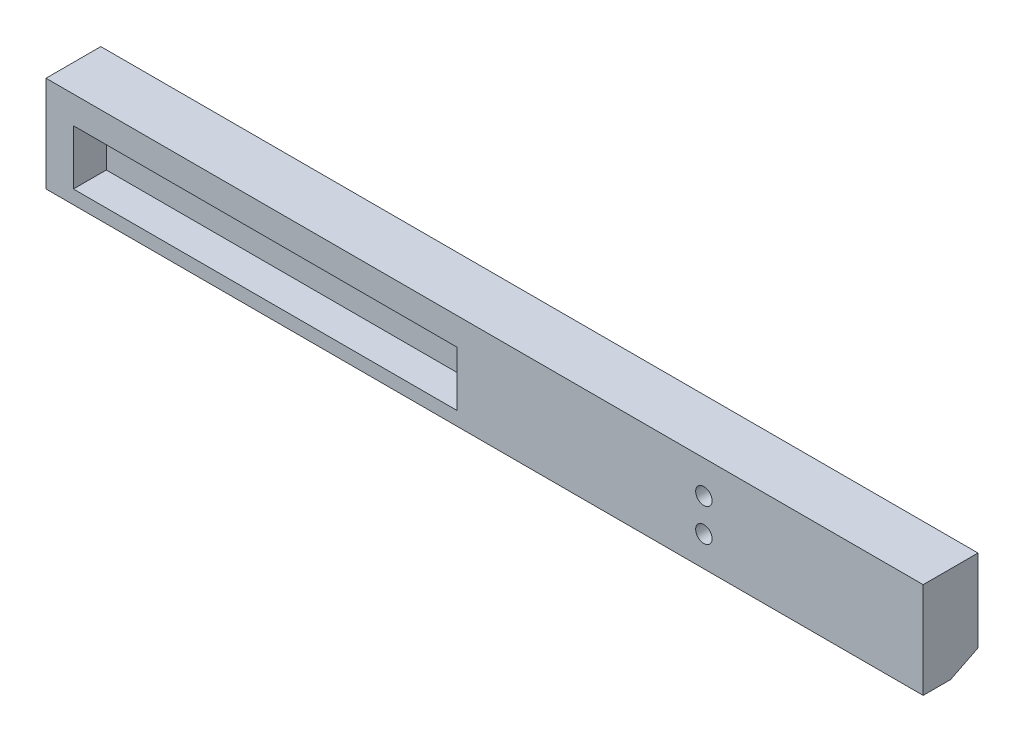
ISO-10303-21;
HEADER;
FILE_DESCRIPTION(('STEP AP214'),'2;1');
FILE_NAME('part.step','',(''),(''),'','','');
FILE_SCHEMA(('AUTOMOTIVE_DESIGN { 1 0 10303 214 1 1 1 1 }'));
ENDSEC;
DATA;
#1=APPLICATION_CONTEXT('core data for automotive mechanical design processes');
#2=APPLICATION_PROTOCOL_DEFINITION('international standard','automotive_design',2000,#1);
#3=PRODUCT_CONTEXT('',#1,'mechanical');
#4=PRODUCT('Part','Part','',(#3));
#5=PRODUCT_RELATED_PRODUCT_CATEGORY('part','',(#4));
#6=PRODUCT_DEFINITION_FORMATION('','',#4);
#7=PRODUCT_DEFINITION_CONTEXT('part definition',#1,'design');
#8=PRODUCT_DEFINITION('design','',#6,#7);
#9=PRODUCT_DEFINITION_SHAPE('','',#8);
#10=(LENGTH_UNIT() NAMED_UNIT(*) SI_UNIT(.MILLI.,.METRE.));
#11=(NAMED_UNIT(*) PLANE_ANGLE_UNIT() SI_UNIT($,.RADIAN.));
#12=(NAMED_UNIT(*) SI_UNIT($,.STERADIAN.) SOLID_ANGLE_UNIT());
#13=UNCERTAINTY_MEASURE_WITH_UNIT(LENGTH_MEASURE(1.E-05),#10,'distance_accuracy_value','');
#14=(GEOMETRIC_REPRESENTATION_CONTEXT(3) GLOBAL_UNCERTAINTY_ASSIGNED_CONTEXT((#13)) GLOBAL_UNIT_ASSIGNED_CONTEXT((#10,
#11,#12)) REPRESENTATION_CONTEXT('',''));
#15=CARTESIAN_POINT('',(0.,0.,0.));
#16=DIRECTION('',(0.,0.,1.));
#17=DIRECTION('',(1.,0.,0.));
#18=AXIS2_PLACEMENT_3D('',#15,#16,#17);
#19=CARTESIAN_POINT('',(-0.01000000000001,3.17499999999996,19.05));
#20=DIRECTION('',(0.,-0.894427190999916,-0.447213595499958));
#21=DIRECTION('',(0.,0.447213595499958,-0.894427190999916));
#22=AXIS2_PLACEMENT_3D('',#19,#20,#21);
#23=PLANE('',#22);
#24=DIRECTION('',(1.,0.,0.));
#25=VECTOR('',#24,1.);
#26=CARTESIAN_POINT('',(-0.01000000000001,3.17499999999996,19.05));
#27=LINE('',#26,#25);
#28=CARTESIAN_POINT('',(0.,3.17499999999995,19.05));
#29=VERTEX_POINT('',#28);
#30=CARTESIAN_POINT('',(203.2,3.17499999999998,19.05));
#31=VERTEX_POINT('',#30);
#32=EDGE_CURVE('E11',#29,#31,#27,.T.);
#33=ORIENTED_EDGE('',*,*,#32,.F.);
#34=DIRECTION('',(0.,0.447213595499958,-0.894427190999916));
#35=VECTOR('',#34,1.);
#36=CARTESIAN_POINT('',(0.,39.37,-53.34));
#37=LINE('',#36,#35);
#38=CARTESIAN_POINT('',(0.,6.35,12.7));
#39=VERTEX_POINT('',#38);
#40=EDGE_CURVE('E111',#29,#39,#37,.T.);
#41=ORIENTED_EDGE('',*,*,#40,.T.);
#42=DIRECTION('',(-1.,0.,0.));
#43=VECTOR('',#42,1.);
#44=CARTESIAN_POINT('',(0.,6.35,12.7));
#45=LINE('',#44,#43);
#46=CARTESIAN_POINT('',(203.2,6.35,12.7));
#47=VERTEX_POINT('',#46);
#48=EDGE_CURVE('E158',#47,#39,#45,.T.);
#49=ORIENTED_EDGE('',*,*,#48,.F.);
#50=DIRECTION('',(0.,-0.447213595499958,0.894427190999916));
#51=VECTOR('',#50,1.);
#52=CARTESIAN_POINT('',(203.2,39.37,-53.34));
#53=LINE('',#52,#51);
#54=EDGE_CURVE('E114',#47,#31,#53,.T.);
#55=ORIENTED_EDGE('',*,*,#54,.T.);
#56=EDGE_LOOP('',(#33,#41,#49,#55));
#57=FACE_BOUND('',#56,.T.);
#58=ADVANCED_FACE('F33',(#57),#23,.T.);
#59=CARTESIAN_POINT('',(-0.01000000000001,3.17499999999996,25.4));
#60=DIRECTION('',(0.,-1.,0.));
#61=DIRECTION('',(1.,0.,0.));
#62=AXIS2_PLACEMENT_3D('',#59,#60,#61);
#63=PLANE('',#62);
#64=DIRECTION('',(1.,0.,0.));
#65=VECTOR('',#64,1.);
#66=CARTESIAN_POINT('',(0.,3.17499999999996,25.4));
#67=LINE('',#66,#65);
#68=CARTESIAN_POINT('',(0.,3.17499999999998,25.4));
#69=VERTEX_POINT('',#68);
#70=CARTESIAN_POINT('',(203.2,3.17499999999998,25.4));
#71=VERTEX_POINT('',#70);
#72=EDGE_CURVE('E130',#69,#71,#67,.T.);
#73=ORIENTED_EDGE('',*,*,#72,.F.);
#74=DIRECTION('',(0.,0.,-1.));
#75=VECTOR('',#74,1.);
#76=CARTESIAN_POINT('',(0.,3.17499999999996,6.35));
#77=LINE('',#76,#75);
#78=EDGE_CURVE('E122',#69,#29,#77,.T.);
#79=ORIENTED_EDGE('',*,*,#78,.T.);
#80=ORIENTED_EDGE('',*,*,#32,.T.);
#81=DIRECTION('',(0.,0.,1.));
#82=VECTOR('',#81,1.);
#83=CARTESIAN_POINT('',(203.2,3.17499999999998,6.35));
#84=LINE('',#83,#82);
#85=EDGE_CURVE('E127',#31,#71,#84,.T.);
#86=ORIENTED_EDGE('',*,*,#85,.T.);
#87=EDGE_LOOP('',(#73,#79,#80,#86));
#88=FACE_BOUND('',#87,.T.);
#89=ADVANCED_FACE('F129',(#88),#63,.T.);
#90=CARTESIAN_POINT('',(0.,0.,17.78));
#91=DIRECTION('',(0.,0.,1.));
#92=DIRECTION('',(1.,0.,0.));
#93=AXIS2_PLACEMENT_3D('',#90,#91,#92);
#94=PLANE('',#93);
#95=DIRECTION('',(0.,-1.,0.));
#96=VECTOR('',#95,1.);
#97=CARTESIAN_POINT('',(6.35,19.05,17.78));
#98=LINE('',#97,#96);
#99=CARTESIAN_POINT('',(6.35,19.05,17.78));
#100=VERTEX_POINT('',#99);
#101=CARTESIAN_POINT('',(6.35,6.35,17.78));
#102=VERTEX_POINT('',#101);
#103=EDGE_CURVE('E168',#100,#102,#98,.T.);
#104=ORIENTED_EDGE('',*,*,#103,.T.);
#105=DIRECTION('',(1.,0.,0.));
#106=VECTOR('',#105,1.);
#107=CARTESIAN_POINT('',(6.35,6.35,17.78));
#108=LINE('',#107,#106);
#109=CARTESIAN_POINT('',(95.25,6.35,17.78));
#110=VERTEX_POINT('',#109);
#111=EDGE_CURVE('E180',#102,#110,#108,.T.);
#112=ORIENTED_EDGE('',*,*,#111,.T.);
#113=DIRECTION('',(0.,1.,0.));
#114=VECTOR('',#113,1.);
#115=CARTESIAN_POINT('',(95.25,19.05,17.78));
#116=LINE('',#115,#114);
#117=CARTESIAN_POINT('',(95.25,19.05,17.78));
#118=VERTEX_POINT('',#117);
#119=EDGE_CURVE('E177',#110,#118,#116,.T.);
#120=ORIENTED_EDGE('',*,*,#119,.T.);
#121=DIRECTION('',(-1.,0.,0.));
#122=VECTOR('',#121,1.);
#123=CARTESIAN_POINT('',(6.35,19.05,17.78));
#124=LINE('',#123,#122);
#125=EDGE_CURVE('E160',#118,#100,#124,.T.);
#126=ORIENTED_EDGE('',*,*,#125,.T.);
#127=EDGE_LOOP('',(#104,#112,#120,#126));
#128=FACE_BOUND('',#127,.T.);
#129=ADVANCED_FACE('F211',(#128),#94,.T.);
#130=CARTESIAN_POINT('',(6.35,6.35,17.78));
#131=DIRECTION('',(0.,-1.,0.));
#132=DIRECTION('',(0.,0.,-1.));
#133=AXIS2_PLACEMENT_3D('',#130,#131,#132);
#134=PLANE('',#133);
#135=DIRECTION('',(1.,0.,0.));
#136=VECTOR('',#135,1.);
#137=CARTESIAN_POINT('',(6.35,6.35,25.4));
#138=LINE('',#137,#136);
#139=CARTESIAN_POINT('',(6.35,6.35,25.4));
#140=VERTEX_POINT('',#139);
#141=CARTESIAN_POINT('',(95.25,6.35,25.4));
#142=VERTEX_POINT('',#141);
#143=EDGE_CURVE('E170',#140,#142,#138,.T.);
#144=ORIENTED_EDGE('',*,*,#143,.T.);
#145=DIRECTION('',(0.,0.,1.));
#146=VECTOR('',#145,1.);
#147=CARTESIAN_POINT('',(95.25,6.35,17.78));
#148=LINE('',#147,#146);
#149=EDGE_CURVE('E52',#110,#142,#148,.T.);
#150=ORIENTED_EDGE('',*,*,#149,.F.);
#151=ORIENTED_EDGE('',*,*,#111,.F.);
#152=DIRECTION('',(0.,0.,1.));
#153=VECTOR('',#152,1.);
#154=CARTESIAN_POINT('',(6.35,6.35,17.78));
#155=LINE('',#154,#153);
#156=EDGE_CURVE('E73',#102,#140,#155,.T.);
#157=ORIENTED_EDGE('',*,*,#156,.T.);
#158=EDGE_LOOP('',(#144,#150,#151,#157));
#159=FACE_BOUND('',#158,.T.);
#160=ADVANCED_FACE('F214',(#159),#134,.F.);
#161=CARTESIAN_POINT('',(95.25,19.05,17.78));
#162=DIRECTION('',(1.,0.,0.));
#163=DIRECTION('',(0.,0.,-1.));
#164=AXIS2_PLACEMENT_3D('',#161,#162,#163);
#165=PLANE('',#164);
#166=DIRECTION('',(0.,1.,0.));
#167=VECTOR('',#166,1.);
#168=CARTESIAN_POINT('',(95.25,19.05,25.4));
#169=LINE('',#168,#167);
#170=CARTESIAN_POINT('',(95.25,19.05,25.4));
#171=VERTEX_POINT('',#170);
#172=EDGE_CURVE('E167',#142,#171,#169,.T.);
#173=ORIENTED_EDGE('',*,*,#172,.T.);
#174=DIRECTION('',(0.,0.,1.));
#175=VECTOR('',#174,1.);
#176=CARTESIAN_POINT('',(95.25,19.05,17.78));
#177=LINE('',#176,#175);
#178=EDGE_CURVE('E162',#118,#171,#177,.T.);
#179=ORIENTED_EDGE('',*,*,#178,.F.);
#180=ORIENTED_EDGE('',*,*,#119,.F.);
#181=ORIENTED_EDGE('',*,*,#149,.T.);
#182=EDGE_LOOP('',(#173,#179,#180,#181));
#183=FACE_BOUND('',#182,.T.);
#184=ADVANCED_FACE('F220',(#183),#165,.F.);
#185=CARTESIAN_POINT('',(6.35,19.05,17.78));
#186=DIRECTION('',(0.,1.,0.));
#187=DIRECTION('',(0.,0.,1.));
#188=AXIS2_PLACEMENT_3D('',#185,#186,#187);
#189=PLANE('',#188);
#190=DIRECTION('',(-1.,0.,0.));
#191=VECTOR('',#190,1.);
#192=CARTESIAN_POINT('',(6.35,19.05,25.4));
#193=LINE('',#192,#191);
#194=CARTESIAN_POINT('',(6.35,19.05,25.4));
#195=VERTEX_POINT('',#194);
#196=EDGE_CURVE('E165',#171,#195,#193,.T.);
#197=ORIENTED_EDGE('',*,*,#196,.T.);
#198=DIRECTION('',(0.,0.,1.));
#199=VECTOR('',#198,1.);
#200=CARTESIAN_POINT('',(6.35,19.05,17.78));
#201=LINE('',#200,#199);
#202=EDGE_CURVE('E75',#100,#195,#201,.T.);
#203=ORIENTED_EDGE('',*,*,#202,.F.);
#204=ORIENTED_EDGE('',*,*,#125,.F.);
#205=ORIENTED_EDGE('',*,*,#178,.T.);
#206=EDGE_LOOP('',(#197,#203,#204,#205));
#207=FACE_BOUND('',#206,.T.);
#208=ADVANCED_FACE('F224',(#207),#189,.F.);
#209=CARTESIAN_POINT('',(6.35,19.05,17.78));
#210=DIRECTION('',(-1.,0.,0.));
#211=DIRECTION('',(0.,-1.,0.));
#212=AXIS2_PLACEMENT_3D('',#209,#210,#211);
#213=PLANE('',#212);
#214=DIRECTION('',(0.,-1.,0.));
#215=VECTOR('',#214,1.);
#216=CARTESIAN_POINT('',(6.35,19.05,25.4));
#217=LINE('',#216,#215);
#218=EDGE_CURVE('E172',#195,#140,#217,.T.);
#219=ORIENTED_EDGE('',*,*,#218,.T.);
#220=ORIENTED_EDGE('',*,*,#156,.F.);
#221=ORIENTED_EDGE('',*,*,#103,.F.);
#222=ORIENTED_EDGE('',*,*,#202,.T.);
#223=EDGE_LOOP('',(#219,#220,#221,#222));
#224=FACE_BOUND('',#223,.T.);
#225=ADVANCED_FACE('F237',(#224),#213,.F.);
#226=CARTESIAN_POINT('',(203.2,158.75,6.35));
#227=DIRECTION('',(-1.,0.,0.));
#228=DIRECTION('',(0.,-1.,0.));
#229=AXIS2_PLACEMENT_3D('',#226,#227,#228);
#230=PLANE('',#229);
#231=ORIENTED_EDGE('',*,*,#85,.F.);
#232=ORIENTED_EDGE('',*,*,#54,.F.);
#233=DIRECTION('',(0.,-1.,0.));
#234=VECTOR('',#233,1.);
#235=CARTESIAN_POINT('',(203.2,25.4,12.7));
#236=LINE('',#235,#234);
#237=CARTESIAN_POINT('',(203.2,25.4,12.7));
#238=VERTEX_POINT('',#237);
#239=EDGE_CURVE('E141',#238,#47,#236,.T.);
#240=ORIENTED_EDGE('',*,*,#239,.F.);
#241=DIRECTION('',(0.,0.,-1.));
#242=VECTOR('',#241,1.);
#243=CARTESIAN_POINT('',(203.2,25.4,25.4));
#244=LINE('',#243,#242);
#245=CARTESIAN_POINT('',(203.2,25.4,25.4));
#246=VERTEX_POINT('',#245);
#247=EDGE_CURVE('E151',#246,#238,#244,.T.);
#248=ORIENTED_EDGE('',*,*,#247,.F.);
#249=DIRECTION('',(0.,1.,0.));
#250=VECTOR('',#249,1.);
#251=CARTESIAN_POINT('',(203.2,6.35,25.4));
#252=LINE('',#251,#250);
#253=EDGE_CURVE('E132',#71,#246,#252,.T.);
#254=ORIENTED_EDGE('',*,*,#253,.F.);
#255=EDGE_LOOP('',(#231,#232,#240,#248,#254));
#256=FACE_BOUND('',#255,.T.);
#257=ADVANCED_FACE('F196',(#256),#230,.F.);
#258=CARTESIAN_POINT('',(0.,25.4,0.));
#259=DIRECTION('',(0.,-1.,0.));
#260=DIRECTION('',(0.,0.,-1.));
#261=AXIS2_PLACEMENT_3D('',#258,#259,#260);
#262=PLANE('',#261);
#263=DIRECTION('',(0.,0.,1.));
#264=VECTOR('',#263,1.);
#265=CARTESIAN_POINT('',(0.,25.4,25.4));
#266=LINE('',#265,#264);
#267=CARTESIAN_POINT('',(0.,25.4,12.7));
#268=VERTEX_POINT('',#267);
#269=CARTESIAN_POINT('',(0.,25.4,25.4));
#270=VERTEX_POINT('',#269);
#271=EDGE_CURVE('E155',#268,#270,#266,.T.);
#272=ORIENTED_EDGE('',*,*,#271,.T.);
#273=DIRECTION('',(1.,0.,0.));
#274=VECTOR('',#273,1.);
#275=CARTESIAN_POINT('',(0.,25.4,25.4));
#276=LINE('',#275,#274);
#277=EDGE_CURVE('E153',#270,#246,#276,.T.);
#278=ORIENTED_EDGE('',*,*,#277,.T.);
#279=ORIENTED_EDGE('',*,*,#247,.T.);
#280=DIRECTION('',(-1.,0.,0.));
#281=VECTOR('',#280,1.);
#282=CARTESIAN_POINT('',(0.,25.4,12.7));
#283=LINE('',#282,#281);
#284=EDGE_CURVE('E147',#238,#268,#283,.T.);
#285=ORIENTED_EDGE('',*,*,#284,.T.);
#286=EDGE_LOOP('',(#272,#278,#279,#285));
#287=FACE_BOUND('',#286,.T.);
#288=ADVANCED_FACE('F199',(#287),#262,.F.);
#289=CARTESIAN_POINT('',(0.,158.75,6.35));
#290=DIRECTION('',(1.,0.,0.));
#291=DIRECTION('',(0.,1.,0.));
#292=AXIS2_PLACEMENT_3D('',#289,#290,#291);
#293=PLANE('',#292);
#294=ORIENTED_EDGE('',*,*,#78,.F.);
#295=DIRECTION('',(0.,-1.,0.));
#296=VECTOR('',#295,1.);
#297=CARTESIAN_POINT('',(0.,6.35,25.4));
#298=LINE('',#297,#296);
#299=EDGE_CURVE('E37',#270,#69,#298,.T.);
#300=ORIENTED_EDGE('',*,*,#299,.F.);
#301=ORIENTED_EDGE('',*,*,#271,.F.);
#302=DIRECTION('',(0.,-1.,0.));
#303=VECTOR('',#302,1.);
#304=CARTESIAN_POINT('',(0.,25.4,12.7));
#305=LINE('',#304,#303);
#306=EDGE_CURVE('E126',#268,#39,#305,.T.);
#307=ORIENTED_EDGE('',*,*,#306,.T.);
#308=ORIENTED_EDGE('',*,*,#40,.F.);
#309=EDGE_LOOP('',(#294,#300,#301,#307,#308));
#310=FACE_BOUND('',#309,.T.);
#311=ADVANCED_FACE('F121',(#310),#293,.F.);
#312=CARTESIAN_POINT('',(152.4,10.16,-0.001000000000001));
#313=DIRECTION('',(0.,0.,1.));
#314=DIRECTION('',(1.,0.,0.));
#315=AXIS2_PLACEMENT_3D('',#312,#313,#314);
#316=CYLINDRICAL_SURFACE('',#315,1.90499999999999);
#317=CARTESIAN_POINT('',(152.4,10.16,25.4));
#318=DIRECTION('',(0.,0.,1.));
#319=DIRECTION('',(1.,0.,0.));
#320=AXIS2_PLACEMENT_3D('',#317,#318,#319);
#321=CIRCLE('',#320,1.90499999999999);
#322=CARTESIAN_POINT('',(154.305,10.16,25.4));
#323=VERTEX_POINT('',#322);
#324=EDGE_CURVE('E185',#323,#323,#321,.T.);
#325=CARTESIAN_POINT('',(152.4,10.16,12.7));
#326=DIRECTION('',(0.,0.,1.));
#327=DIRECTION('',(1.,0.,0.));
#328=AXIS2_PLACEMENT_3D('',#325,#326,#327);
#329=CIRCLE('',#328,1.90499999999999);
#330=CARTESIAN_POINT('',(154.305,10.16,12.7));
#331=VERTEX_POINT('',#330);
#332=EDGE_CURVE('E43',#331,#331,#329,.F.);
#333=CARTESIAN_POINT('',(154.305,10.16,25.4));
#334=CARTESIAN_POINT('',(154.305,10.16,25.2677083333333));
#335=CARTESIAN_POINT('',(154.305,10.16,25.1354166666667));
#336=CARTESIAN_POINT('',(154.305,10.16,24.8708333333333));
#337=CARTESIAN_POINT('',(154.305,10.16,24.7385416666667));
#338=CARTESIAN_POINT('',(154.305,10.16,24.4739583333333));
#339=CARTESIAN_POINT('',(154.305,10.16,24.3416666666667));
#340=CARTESIAN_POINT('',(154.305,10.16,24.0770833333333));
#341=CARTESIAN_POINT('',(154.305,10.16,23.9447916666667));
#342=CARTESIAN_POINT('',(154.305,10.16,23.6802083333333));
#343=CARTESIAN_POINT('',(154.305,10.16,23.5479166666667));
#344=CARTESIAN_POINT('',(154.305,10.16,23.2833333333333));
#345=CARTESIAN_POINT('',(154.305,10.16,23.1510416666667));
#346=CARTESIAN_POINT('',(154.305,10.16,22.8864583333333));
#347=CARTESIAN_POINT('',(154.305,10.16,22.7541666666667));
#348=CARTESIAN_POINT('',(154.305,10.16,22.4895833333333));
#349=CARTESIAN_POINT('',(154.305,10.16,22.3572916666667));
#350=CARTESIAN_POINT('',(154.305,10.16,22.0927083333333));
#351=CARTESIAN_POINT('',(154.305,10.16,21.9604166666667));
#352=CARTESIAN_POINT('',(154.305,10.16,21.6958333333333));
#353=CARTESIAN_POINT('',(154.305,10.16,21.5635416666667));
#354=CARTESIAN_POINT('',(154.305,10.16,21.2989583333333));
#355=CARTESIAN_POINT('',(154.305,10.16,21.1666666666667));
#356=CARTESIAN_POINT('',(154.305,10.16,20.9020833333333));
#357=CARTESIAN_POINT('',(154.305,10.16,20.7697916666667));
#358=CARTESIAN_POINT('',(154.305,10.16,20.5052083333333));
#359=CARTESIAN_POINT('',(154.305,10.16,20.3729166666667));
#360=CARTESIAN_POINT('',(154.305,10.16,20.1083333333333));
#361=CARTESIAN_POINT('',(154.305,10.16,19.9760416666667));
#362=CARTESIAN_POINT('',(154.305,10.16,19.7114583333333));
#363=CARTESIAN_POINT('',(154.305,10.16,19.5791666666667));
#364=CARTESIAN_POINT('',(154.305,10.16,19.3145833333333));
#365=CARTESIAN_POINT('',(154.305,10.16,19.1822916666667));
#366=CARTESIAN_POINT('',(154.305,10.16,18.9177083333333));
#367=CARTESIAN_POINT('',(154.305,10.16,18.7854166666667));
#368=CARTESIAN_POINT('',(154.305,10.16,18.5208333333333));
#369=CARTESIAN_POINT('',(154.305,10.16,18.3885416666667));
#370=CARTESIAN_POINT('',(154.305,10.16,18.1239583333333));
#371=CARTESIAN_POINT('',(154.305,10.16,17.9916666666667));
#372=CARTESIAN_POINT('',(154.305,10.16,17.7270833333333));
#373=CARTESIAN_POINT('',(154.305,10.16,17.5947916666667));
#374=CARTESIAN_POINT('',(154.305,10.16,17.3302083333333));
#375=CARTESIAN_POINT('',(154.305,10.16,17.1979166666667));
#376=CARTESIAN_POINT('',(154.305,10.16,16.9333333333333));
#377=CARTESIAN_POINT('',(154.305,10.16,16.8010416666667));
#378=CARTESIAN_POINT('',(154.305,10.16,16.5364583333333));
#379=CARTESIAN_POINT('',(154.305,10.16,16.4041666666667));
#380=CARTESIAN_POINT('',(154.305,10.16,16.1395833333333));
#381=CARTESIAN_POINT('',(154.305,10.16,16.0072916666667));
#382=CARTESIAN_POINT('',(154.305,10.16,15.7427083333333));
#383=CARTESIAN_POINT('',(154.305,10.16,15.6104166666667));
#384=CARTESIAN_POINT('',(154.305,10.16,15.3458333333333));
#385=CARTESIAN_POINT('',(154.305,10.16,15.2135416666667));
#386=CARTESIAN_POINT('',(154.305,10.16,14.9489583333333));
#387=CARTESIAN_POINT('',(154.305,10.16,14.8166666666667));
#388=CARTESIAN_POINT('',(154.305,10.16,14.5520833333333));
#389=CARTESIAN_POINT('',(154.305,10.16,14.4197916666667));
#390=CARTESIAN_POINT('',(154.305,10.16,14.1552083333333));
#391=CARTESIAN_POINT('',(154.305,10.16,14.0229166666667));
#392=CARTESIAN_POINT('',(154.305,10.16,13.7583333333333));
#393=CARTESIAN_POINT('',(154.305,10.16,13.6260416666667));
#394=CARTESIAN_POINT('',(154.305,10.16,13.3614583333333));
#395=CARTESIAN_POINT('',(154.305,10.16,13.2291666666667));
#396=CARTESIAN_POINT('',(154.305,10.16,12.9645833333333));
#397=CARTESIAN_POINT('',(154.305,10.16,12.8322916666667));
#398=CARTESIAN_POINT('',(154.305,10.16,12.7));
#399=B_SPLINE_CURVE_WITH_KNOTS('',3,(#333,#334,#335,#336,#337,#338,#339,#340,#341,#342,#343,
#344,#345,#346,#347,#348,#349,#350,#351,#352,#353,#354,#355,#356,#357,#358,#359,#360,#361,#362,
#363,#364,#365,#366,#367,#368,#369,#370,#371,#372,#373,#374,#375,#376,#377,#378,#379,#380,#381,
#382,#383,#384,#385,#386,#387,#388,#389,#390,#391,#392,#393,#394,#395,#396,#397,#398),
.UNSPECIFIED.,.F.,.F.,(4,2,2,2,2,2,2,2,2,2,2,2,2,2,2,2,2,2,2,2,2,2,2,2,2,2,2,2,2,2,2,2,4),(0.,
0.396875000000001,0.793749999999999,1.190625,1.5875,1.984375,2.38125,2.778125,3.175,3.571875,
3.96875,4.365625,4.7625,5.159375,5.55625,5.953125,6.35,6.746875,7.14375,7.540625,7.9375,
8.334375,8.73125,9.128125,9.525,9.921875,10.31875,10.715625,11.1125,11.509375,11.90625,
12.303125,12.7),.UNSPECIFIED.);
#400=EDGE_CURVE('BSEAM226',#323,#331,#399,.T.);
#401=ORIENTED_EDGE('',*,*,#324,.T.);
#402=ORIENTED_EDGE('',*,*,#332,.T.);
#403=ORIENTED_EDGE('',*,*,#400,.T.);
#404=ORIENTED_EDGE('',*,*,#400,.F.);
#405=EDGE_LOOP('',(#401,#403,#402,#404));
#406=FACE_BOUND('',#405,.T.);
#407=ADVANCED_FACE('F226',(#406),#316,.F.);
#408=CARTESIAN_POINT('',(152.4,17.78,-0.001000000000001));
#409=DIRECTION('',(0.,0.,1.));
#410=DIRECTION('',(1.,0.,0.));
#411=AXIS2_PLACEMENT_3D('',#408,#409,#410);
#412=CYLINDRICAL_SURFACE('',#411,1.90499999999999);
#413=CARTESIAN_POINT('',(152.4,17.78,25.4));
#414=DIRECTION('',(0.,0.,1.));
#415=DIRECTION('',(1.,0.,0.));
#416=AXIS2_PLACEMENT_3D('',#413,#414,#415);
#417=CIRCLE('',#416,1.90499999999999);
#418=CARTESIAN_POINT('',(154.305,17.78,25.4));
#419=VERTEX_POINT('',#418);
#420=EDGE_CURVE('E174',#419,#419,#417,.T.);
#421=CARTESIAN_POINT('',(152.4,17.78,12.7));
#422=DIRECTION('',(0.,0.,1.));
#423=DIRECTION('',(1.,0.,0.));
#424=AXIS2_PLACEMENT_3D('',#421,#422,#423);
#425=CIRCLE('',#424,1.90499999999999);
#426=CARTESIAN_POINT('',(154.305,17.78,12.7));
#427=VERTEX_POINT('',#426);
#428=EDGE_CURVE('E188',#427,#427,#425,.F.);
#429=CARTESIAN_POINT('',(154.305,17.78,25.4));
#430=CARTESIAN_POINT('',(154.305,17.78,25.2677083333333));
#431=CARTESIAN_POINT('',(154.305,17.78,25.1354166666667));
#432=CARTESIAN_POINT('',(154.305,17.78,24.8708333333333));
#433=CARTESIAN_POINT('',(154.305,17.78,24.7385416666667));
#434=CARTESIAN_POINT('',(154.305,17.78,24.4739583333333));
#435=CARTESIAN_POINT('',(154.305,17.78,24.3416666666667));
#436=CARTESIAN_POINT('',(154.305,17.78,24.0770833333333));
#437=CARTESIAN_POINT('',(154.305,17.78,23.9447916666667));
#438=CARTESIAN_POINT('',(154.305,17.78,23.6802083333333));
#439=CARTESIAN_POINT('',(154.305,17.78,23.5479166666667));
#440=CARTESIAN_POINT('',(154.305,17.78,23.2833333333333));
#441=CARTESIAN_POINT('',(154.305,17.78,23.1510416666667));
#442=CARTESIAN_POINT('',(154.305,17.78,22.8864583333333));
#443=CARTESIAN_POINT('',(154.305,17.78,22.7541666666667));
#444=CARTESIAN_POINT('',(154.305,17.78,22.4895833333333));
#445=CARTESIAN_POINT('',(154.305,17.78,22.3572916666667));
#446=CARTESIAN_POINT('',(154.305,17.78,22.0927083333333));
#447=CARTESIAN_POINT('',(154.305,17.78,21.9604166666667));
#448=CARTESIAN_POINT('',(154.305,17.78,21.6958333333333));
#449=CARTESIAN_POINT('',(154.305,17.78,21.5635416666667));
#450=CARTESIAN_POINT('',(154.305,17.78,21.2989583333333));
#451=CARTESIAN_POINT('',(154.305,17.78,21.1666666666667));
#452=CARTESIAN_POINT('',(154.305,17.78,20.9020833333333));
#453=CARTESIAN_POINT('',(154.305,17.78,20.7697916666667));
#454=CARTESIAN_POINT('',(154.305,17.78,20.5052083333333));
#455=CARTESIAN_POINT('',(154.305,17.78,20.3729166666667));
#456=CARTESIAN_POINT('',(154.305,17.78,20.1083333333333));
#457=CARTESIAN_POINT('',(154.305,17.78,19.9760416666667));
#458=CARTESIAN_POINT('',(154.305,17.78,19.7114583333333));
#459=CARTESIAN_POINT('',(154.305,17.78,19.5791666666667));
#460=CARTESIAN_POINT('',(154.305,17.78,19.3145833333333));
#461=CARTESIAN_POINT('',(154.305,17.78,19.1822916666667));
#462=CARTESIAN_POINT('',(154.305,17.78,18.9177083333333));
#463=CARTESIAN_POINT('',(154.305,17.78,18.7854166666667));
#464=CARTESIAN_POINT('',(154.305,17.78,18.5208333333333));
#465=CARTESIAN_POINT('',(154.305,17.78,18.3885416666667));
#466=CARTESIAN_POINT('',(154.305,17.78,18.1239583333333));
#467=CARTESIAN_POINT('',(154.305,17.78,17.9916666666667));
#468=CARTESIAN_POINT('',(154.305,17.78,17.7270833333333));
#469=CARTESIAN_POINT('',(154.305,17.78,17.5947916666667));
#470=CARTESIAN_POINT('',(154.305,17.78,17.3302083333333));
#471=CARTESIAN_POINT('',(154.305,17.78,17.1979166666667));
#472=CARTESIAN_POINT('',(154.305,17.78,16.9333333333333));
#473=CARTESIAN_POINT('',(154.305,17.78,16.8010416666667));
#474=CARTESIAN_POINT('',(154.305,17.78,16.5364583333333));
#475=CARTESIAN_POINT('',(154.305,17.78,16.4041666666667));
#476=CARTESIAN_POINT('',(154.305,17.78,16.1395833333333));
#477=CARTESIAN_POINT('',(154.305,17.78,16.0072916666667));
#478=CARTESIAN_POINT('',(154.305,17.78,15.7427083333333));
#479=CARTESIAN_POINT('',(154.305,17.78,15.6104166666667));
#480=CARTESIAN_POINT('',(154.305,17.78,15.3458333333333));
#481=CARTESIAN_POINT('',(154.305,17.78,15.2135416666667));
#482=CARTESIAN_POINT('',(154.305,17.78,14.9489583333333));
#483=CARTESIAN_POINT('',(154.305,17.78,14.8166666666667));
#484=CARTESIAN_POINT('',(154.305,17.78,14.5520833333333));
#485=CARTESIAN_POINT('',(154.305,17.78,14.4197916666667));
#486=CARTESIAN_POINT('',(154.305,17.78,14.1552083333333));
#487=CARTESIAN_POINT('',(154.305,17.78,14.0229166666667));
#488=CARTESIAN_POINT('',(154.305,17.78,13.7583333333333));
#489=CARTESIAN_POINT('',(154.305,17.78,13.6260416666667));
#490=CARTESIAN_POINT('',(154.305,17.78,13.3614583333333));
#491=CARTESIAN_POINT('',(154.305,17.78,13.2291666666667));
#492=CARTESIAN_POINT('',(154.305,17.78,12.9645833333333));
#493=CARTESIAN_POINT('',(154.305,17.78,12.8322916666667));
#494=CARTESIAN_POINT('',(154.305,17.78,12.7));
#495=B_SPLINE_CURVE_WITH_KNOTS('',3,(#429,#430,#431,#432,#433,#434,#435,#436,#437,#438,#439,
#440,#441,#442,#443,#444,#445,#446,#447,#448,#449,#450,#451,#452,#453,#454,#455,#456,#457,#458,
#459,#460,#461,#462,#463,#464,#465,#466,#467,#468,#469,#470,#471,#472,#473,#474,#475,#476,#477,
#478,#479,#480,#481,#482,#483,#484,#485,#486,#487,#488,#489,#490,#491,#492,#493,#494),
.UNSPECIFIED.,.F.,.F.,(4,2,2,2,2,2,2,2,2,2,2,2,2,2,2,2,2,2,2,2,2,2,2,2,2,2,2,2,2,2,2,2,4),(0.,
0.396875000000001,0.793749999999999,1.190625,1.5875,1.984375,2.38125,2.778125,3.175,3.571875,
3.96875,4.365625,4.7625,5.159375,5.55625,5.953125,6.35,6.746875,7.14375,7.540625,7.9375,
8.334375,8.73125,9.128125,9.525,9.921875,10.31875,10.715625,11.1125,11.509375,11.90625,
12.303125,12.7),.UNSPECIFIED.);
#496=EDGE_CURVE('BSEAM205',#419,#427,#495,.T.);
#497=ORIENTED_EDGE('',*,*,#420,.T.);
#498=ORIENTED_EDGE('',*,*,#428,.T.);
#499=ORIENTED_EDGE('',*,*,#496,.T.);
#500=ORIENTED_EDGE('',*,*,#496,.F.);
#501=EDGE_LOOP('',(#497,#499,#498,#500));
#502=FACE_BOUND('',#501,.T.);
#503=ADVANCED_FACE('F205',(#502),#412,.F.);
#504=CARTESIAN_POINT('',(0.,25.4,12.7));
#505=DIRECTION('',(0.,0.,1.));
#506=DIRECTION('',(1.,0.,0.));
#507=AXIS2_PLACEMENT_3D('',#504,#505,#506);
#508=PLANE('',#507);
#509=ORIENTED_EDGE('',*,*,#428,.F.);
#510=EDGE_LOOP('',(#509));
#511=FACE_BOUND('',#510,.T.);
#512=ORIENTED_EDGE('',*,*,#332,.F.);
#513=EDGE_LOOP('',(#512));
#514=FACE_BOUND('',#513,.T.);
#515=ORIENTED_EDGE('',*,*,#48,.T.);
#516=ORIENTED_EDGE('',*,*,#306,.F.);
#517=ORIENTED_EDGE('',*,*,#284,.F.);
#518=ORIENTED_EDGE('',*,*,#239,.T.);
#519=EDGE_LOOP('',(#515,#516,#517,#518));
#520=FACE_BOUND('',#519,.T.);
#521=ADVANCED_FACE('F194',(#511,#514,#520),#508,.F.);
#522=CARTESIAN_POINT('',(0.,0.,25.4));
#523=DIRECTION('',(0.,0.,1.));
#524=DIRECTION('',(1.,0.,0.));
#525=AXIS2_PLACEMENT_3D('',#522,#523,#524);
#526=PLANE('',#525);
#527=ORIENTED_EDGE('',*,*,#420,.F.);
#528=EDGE_LOOP('',(#527));
#529=FACE_BOUND('',#528,.T.);
#530=ORIENTED_EDGE('',*,*,#324,.F.);
#531=EDGE_LOOP('',(#530));
#532=FACE_BOUND('',#531,.T.);
#533=ORIENTED_EDGE('',*,*,#218,.F.);
#534=ORIENTED_EDGE('',*,*,#196,.F.);
#535=ORIENTED_EDGE('',*,*,#172,.F.);
#536=ORIENTED_EDGE('',*,*,#143,.F.);
#537=EDGE_LOOP('',(#533,#534,#535,#536));
#538=FACE_BOUND('',#537,.T.);
#539=ORIENTED_EDGE('',*,*,#299,.T.);
#540=ORIENTED_EDGE('',*,*,#72,.T.);
#541=ORIENTED_EDGE('',*,*,#253,.T.);
#542=ORIENTED_EDGE('',*,*,#277,.F.);
#543=EDGE_LOOP('',(#539,#540,#541,#542));
#544=FACE_BOUND('',#543,.T.);
#545=ADVANCED_FACE('F35',(#529,#532,#538,#544),#526,.T.);
#546=CLOSED_SHELL('',(#58,#89,#129,#160,#184,#208,#225,#257,#288,#311,#407,#503,#521,#545));
#547=MANIFOLD_SOLID_BREP('B2',#546);
#548=ADVANCED_BREP_SHAPE_REPRESENTATION('',(#18,#547),#14);
#549=SHAPE_DEFINITION_REPRESENTATION(#9,#548);
ENDSEC;
END-ISO-10303-21;
